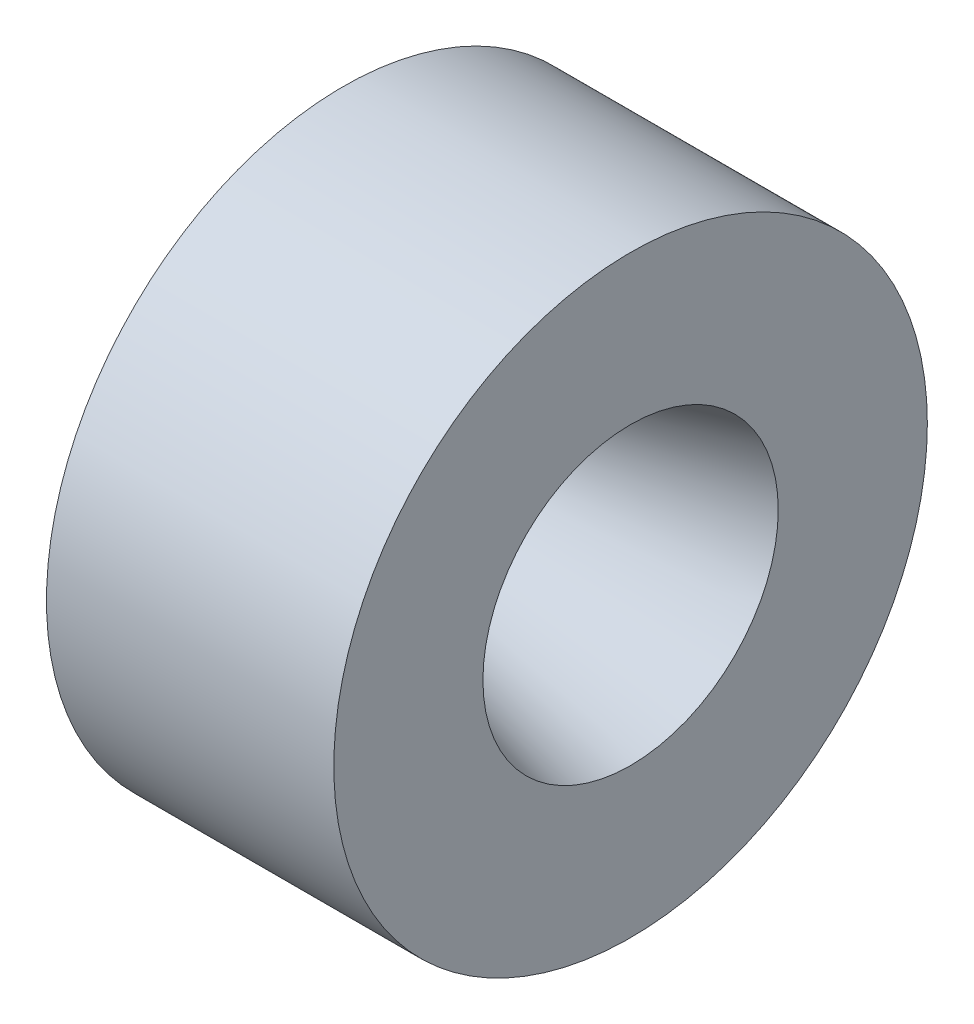
ISO-10303-21;
HEADER;
FILE_DESCRIPTION(('STEP AP214'),'2;1');
FILE_NAME('part.step','',(''),(''),'','','');
FILE_SCHEMA(('AUTOMOTIVE_DESIGN { 1 0 10303 214 1 1 1 1 }'));
ENDSEC;
DATA;
#1=APPLICATION_CONTEXT('core data for automotive mechanical design processes');
#2=APPLICATION_PROTOCOL_DEFINITION('international standard','automotive_design',2000,#1);
#3=PRODUCT_CONTEXT('',#1,'mechanical');
#4=PRODUCT('Part','Part','',(#3));
#5=PRODUCT_RELATED_PRODUCT_CATEGORY('part','',(#4));
#6=PRODUCT_DEFINITION_FORMATION('','',#4);
#7=PRODUCT_DEFINITION_CONTEXT('part definition',#1,'design');
#8=PRODUCT_DEFINITION('design','',#6,#7);
#9=PRODUCT_DEFINITION_SHAPE('','',#8);
#10=(LENGTH_UNIT() NAMED_UNIT(*) SI_UNIT(.MILLI.,.METRE.));
#11=(NAMED_UNIT(*) PLANE_ANGLE_UNIT() SI_UNIT($,.RADIAN.));
#12=(NAMED_UNIT(*) SI_UNIT($,.STERADIAN.) SOLID_ANGLE_UNIT());
#13=UNCERTAINTY_MEASURE_WITH_UNIT(LENGTH_MEASURE(1.E-05),#10,'distance_accuracy_value','');
#14=(GEOMETRIC_REPRESENTATION_CONTEXT(3) GLOBAL_UNCERTAINTY_ASSIGNED_CONTEXT((#13)) GLOBAL_UNIT_ASSIGNED_CONTEXT((#10,
#11,#12)) REPRESENTATION_CONTEXT('',''));
#15=CARTESIAN_POINT('',(0.,0.,0.));
#16=DIRECTION('',(0.,0.,1.));
#17=DIRECTION('',(1.,0.,0.));
#18=AXIS2_PLACEMENT_3D('',#15,#16,#17);
#19=CARTESIAN_POINT('',(152.7302,0.,0.));
#20=DIRECTION('',(1.,0.,0.));
#21=DIRECTION('',(0.,0.,-1.));
#22=AXIS2_PLACEMENT_3D('',#19,#20,#21);
#23=CYLINDRICAL_SURFACE('',#22,52.07);
#24=CARTESIAN_POINT('',(154.3304,0.,0.));
#25=DIRECTION('',(1.,0.,0.));
#26=DIRECTION('',(0.,0.,-1.));
#27=AXIS2_PLACEMENT_3D('',#24,#25,#26);
#28=CIRCLE('',#27,52.07);
#29=CARTESIAN_POINT('',(154.3304,0.,-52.07));
#30=VERTEX_POINT('',#29);
#31=EDGE_CURVE('E64',#30,#30,#28,.T.);
#32=ORIENTED_EDGE('',*,*,#31,.T.);
#33=EDGE_LOOP('',(#32));
#34=FACE_BOUND('',#33,.T.);
#35=CARTESIAN_POINT('',(204.742077662236,0.,0.));
#36=DIRECTION('',(1.,0.,0.));
#37=DIRECTION('',(0.,0.,-1.));
#38=AXIS2_PLACEMENT_3D('',#35,#36,#37);
#39=CIRCLE('',#38,52.07);
#40=CARTESIAN_POINT('',(204.742077662236,0.,-52.07));
#41=VERTEX_POINT('',#40);
#42=EDGE_CURVE('E76',#41,#41,#39,.T.);
#43=ORIENTED_EDGE('',*,*,#42,.F.);
#44=EDGE_LOOP('',(#43));
#45=FACE_BOUND('',#44,.T.);
#46=ADVANCED_FACE('F38',(#34,#45),#23,.T.);
#47=CARTESIAN_POINT('',(154.3304,52.07,0.));
#48=DIRECTION('',(-1.,0.,0.));
#49=DIRECTION('',(0.,0.,1.));
#50=AXIS2_PLACEMENT_3D('',#47,#48,#49);
#51=PLANE('',#50);
#52=CARTESIAN_POINT('',(154.3304,0.,0.));
#53=DIRECTION('',(-1.,0.,0.));
#54=DIRECTION('',(0.,0.,1.));
#55=AXIS2_PLACEMENT_3D('',#52,#53,#54);
#56=CIRCLE('',#55,43.942);
#57=CARTESIAN_POINT('',(154.3304,0.,43.942));
#58=VERTEX_POINT('',#57);
#59=EDGE_CURVE('E61',#58,#58,#56,.F.);
#60=ORIENTED_EDGE('',*,*,#59,.T.);
#61=EDGE_LOOP('',(#60));
#62=FACE_BOUND('',#61,.T.);
#63=ORIENTED_EDGE('',*,*,#31,.F.);
#64=EDGE_LOOP('',(#63));
#65=FACE_BOUND('',#64,.T.);
#66=ADVANCED_FACE('F84',(#62,#65),#51,.T.);
#67=CARTESIAN_POINT('',(152.7302,0.,0.));
#68=DIRECTION('',(1.,0.,0.));
#69=DIRECTION('',(0.,0.,-1.));
#70=AXIS2_PLACEMENT_3D('',#67,#68,#69);
#71=CYLINDRICAL_SURFACE('',#70,43.688);
#72=CARTESIAN_POINT('',(154.0764,0.,0.));
#73=DIRECTION('',(-1.,0.,0.));
#74=DIRECTION('',(0.,0.,1.));
#75=AXIS2_PLACEMENT_3D('',#72,#73,#74);
#76=CIRCLE('',#75,43.688);
#77=CARTESIAN_POINT('',(154.0764,0.,43.688));
#78=VERTEX_POINT('',#77);
#79=EDGE_CURVE('E58',#78,#78,#76,.T.);
#80=ORIENTED_EDGE('',*,*,#79,.T.);
#81=EDGE_LOOP('',(#80));
#82=FACE_BOUND('',#81,.T.);
#83=CARTESIAN_POINT('',(151.7904,0.,0.));
#84=DIRECTION('',(1.,0.,0.));
#85=DIRECTION('',(0.,0.,-1.));
#86=AXIS2_PLACEMENT_3D('',#83,#84,#85);
#87=CIRCLE('',#86,43.688);
#88=CARTESIAN_POINT('',(151.7904,0.,-43.688));
#89=VERTEX_POINT('',#88);
#90=EDGE_CURVE('E67',#89,#89,#87,.T.);
#91=ORIENTED_EDGE('',*,*,#90,.T.);
#92=EDGE_LOOP('',(#91));
#93=FACE_BOUND('',#92,.T.);
#94=ADVANCED_FACE('F91',(#82,#93),#71,.T.);
#95=CARTESIAN_POINT('',(151.7904,43.688,0.));
#96=DIRECTION('',(-1.,0.,0.));
#97=DIRECTION('',(0.,0.,1.));
#98=AXIS2_PLACEMENT_3D('',#95,#96,#97);
#99=PLANE('',#98);
#100=CARTESIAN_POINT('',(151.7904,0.,0.));
#101=DIRECTION('',(1.,0.,0.));
#102=DIRECTION('',(0.,0.,-1.));
#103=AXIS2_PLACEMENT_3D('',#100,#101,#102);
#104=CIRCLE('',#103,41.148);
#105=CARTESIAN_POINT('',(151.7904,0.,-41.148));
#106=VERTEX_POINT('',#105);
#107=EDGE_CURVE('E70',#106,#106,#104,.T.);
#108=ORIENTED_EDGE('',*,*,#107,.T.);
#109=EDGE_LOOP('',(#108));
#110=FACE_BOUND('',#109,.T.);
#111=ORIENTED_EDGE('',*,*,#90,.F.);
#112=EDGE_LOOP('',(#111));
#113=FACE_BOUND('',#112,.T.);
#114=ADVANCED_FACE('F123',(#110,#113),#99,.T.);
#115=CARTESIAN_POINT('',(152.7302,0.,0.));
#116=DIRECTION('',(1.,0.,0.));
#117=DIRECTION('',(0.,0.,-1.));
#118=AXIS2_PLACEMENT_3D('',#115,#116,#117);
#119=CYLINDRICAL_SURFACE('',#118,41.148);
#120=CARTESIAN_POINT('',(152.347039537398,0.,0.));
#121=DIRECTION('',(1.,0.,0.));
#122=DIRECTION('',(0.,0.,-1.));
#123=AXIS2_PLACEMENT_3D('',#120,#121,#122);
#124=CIRCLE('',#123,41.148);
#125=CARTESIAN_POINT('',(152.347039537398,0.,-41.148));
#126=VERTEX_POINT('',#125);
#127=EDGE_CURVE('E45',#126,#126,#124,.T.);
#128=ORIENTED_EDGE('',*,*,#127,.T.);
#129=EDGE_LOOP('',(#128));
#130=FACE_BOUND('',#129,.T.);
#131=ORIENTED_EDGE('',*,*,#107,.F.);
#132=EDGE_LOOP('',(#131));
#133=FACE_BOUND('',#132,.T.);
#134=ADVANCED_FACE('F114',(#130,#133),#119,.F.);
#135=CARTESIAN_POINT('',(154.3304,0.,0.));
#136=DIRECTION('',(-1.,0.,0.));
#137=DIRECTION('',(0.,0.,1.));
#138=AXIS2_PLACEMENT_3D('',#135,#136,#137);
#139=CONICAL_SURFACE('',#138,41.148,0.959931088596884);
#140=CARTESIAN_POINT('',(155.468008826139,0.,0.));
#141=DIRECTION('',(-1.,0.,0.));
#142=DIRECTION('',(0.,0.,1.));
#143=AXIS2_PLACEMENT_3D('',#140,#141,#142);
#144=CIRCLE('',#143,39.5233262224975);
#145=CARTESIAN_POINT('',(155.468008826139,0.,39.5233262224975));
#146=VERTEX_POINT('',#145);
#147=EDGE_CURVE('E10',#146,#146,#144,.T.);
#148=ORIENTED_EDGE('',*,*,#147,.T.);
#149=EDGE_LOOP('',(#148));
#150=FACE_BOUND('',#149,.T.);
#151=CARTESIAN_POINT('',(170.769703079932,0.,0.));
#152=DIRECTION('',(1.,0.,0.));
#153=DIRECTION('',(0.,0.,-1.));
#154=AXIS2_PLACEMENT_3D('',#151,#152,#153);
#155=CIRCLE('',#154,17.6702420741658);
#156=CARTESIAN_POINT('',(170.769703079932,0.,-17.6702420741658));
#157=VERTEX_POINT('',#156);
#158=EDGE_CURVE('E53',#157,#157,#155,.T.);
#159=ORIENTED_EDGE('',*,*,#158,.T.);
#160=EDGE_LOOP('',(#159));
#161=FACE_BOUND('',#160,.T.);
#162=ADVANCED_FACE('F111',(#150,#161),#139,.F.);
#163=CARTESIAN_POINT('',(171.279763711412,0.,0.));
#164=DIRECTION('',(1.,0.,0.));
#165=DIRECTION('',(0.,0.,-1.));
#166=AXIS2_PLACEMENT_3D('',#163,#164,#165);
#167=CONICAL_SURFACE('',#166,16.9418,0.26179938779915);
#168=CARTESIAN_POINT('',(172.138726363459,0.,0.));
#169=DIRECTION('',(-1.,0.,0.));
#170=DIRECTION('',(0.,0.,1.));
#171=AXIS2_PLACEMENT_3D('',#168,#169,#170);
#172=CIRCLE('',#171,17.1719583489445);
#173=CARTESIAN_POINT('',(172.138726363459,0.,17.1719583489445));
#174=VERTEX_POINT('',#173);
#175=EDGE_CURVE('E49',#174,#174,#172,.T.);
#176=ORIENTED_EDGE('',*,*,#175,.T.);
#177=EDGE_LOOP('',(#176));
#178=FACE_BOUND('',#177,.T.);
#179=CARTESIAN_POINT('',(204.742077662236,0.,0.));
#180=DIRECTION('',(1.,0.,0.));
#181=DIRECTION('',(0.,0.,-1.));
#182=AXIS2_PLACEMENT_3D('',#179,#180,#181);
#183=CIRCLE('',#182,25.908);
#184=CARTESIAN_POINT('',(204.742077662236,0.,-25.908));
#185=VERTEX_POINT('',#184);
#186=EDGE_CURVE('E73',#185,#185,#183,.T.);
#187=ORIENTED_EDGE('',*,*,#186,.T.);
#188=EDGE_LOOP('',(#187));
#189=FACE_BOUND('',#188,.T.);
#190=ADVANCED_FACE('F113',(#178,#189),#167,.F.);
#191=CARTESIAN_POINT('',(204.742077662236,25.908,0.));
#192=DIRECTION('',(1.,0.,0.));
#193=DIRECTION('',(0.,0.,-1.));
#194=AXIS2_PLACEMENT_3D('',#191,#192,#193);
#195=PLANE('',#194);
#196=ORIENTED_EDGE('',*,*,#42,.T.);
#197=EDGE_LOOP('',(#196));
#198=FACE_BOUND('',#197,.T.);
#199=ORIENTED_EDGE('',*,*,#186,.F.);
#200=EDGE_LOOP('',(#199));
#201=FACE_BOUND('',#200,.T.);
#202=ADVANCED_FACE('F80',(#198,#201),#195,.T.);
#203=CARTESIAN_POINT('',(154.0764,0.,0.));
#204=DIRECTION('',(-1.,0.,0.));
#205=DIRECTION('',(0.,0.,1.));
#206=AXIS2_PLACEMENT_3D('',#203,#204,#205);
#207=TOROIDAL_SURFACE('',#206,43.942,0.254);
#208=ORIENTED_EDGE('',*,*,#79,.F.);
#209=EDGE_LOOP('',(#208));
#210=FACE_BOUND('',#209,.T.);
#211=ORIENTED_EDGE('',*,*,#59,.F.);
#212=EDGE_LOOP('',(#211));
#213=FACE_BOUND('',#212,.T.);
#214=ADVANCED_FACE('F96',(#210,#213),#207,.F.);
#215=CARTESIAN_POINT('',(171.810026176179,0.,0.));
#216=DIRECTION('',(-1.,0.,0.));
#217=DIRECTION('',(0.,0.,1.));
#218=AXIS2_PLACEMENT_3D('',#215,#216,#217);
#219=TOROIDAL_SURFACE('',#218,18.3986841483317,1.27);
#220=ORIENTED_EDGE('',*,*,#175,.F.);
#221=EDGE_LOOP('',(#220));
#222=FACE_BOUND('',#221,.T.);
#223=ORIENTED_EDGE('',*,*,#158,.F.);
#224=EDGE_LOOP('',(#223));
#225=FACE_BOUND('',#224,.T.);
#226=ADVANCED_FACE('F98',(#222,#225),#219,.T.);
#227=CARTESIAN_POINT('',(152.347039537398,0.,0.));
#228=DIRECTION('',(1.,0.,0.));
#229=DIRECTION('',(0.,0.,-1.));
#230=AXIS2_PLACEMENT_3D('',#227,#228,#229);
#231=TOROIDAL_SURFACE('',#230,37.338,3.81);
#232=ORIENTED_EDGE('',*,*,#147,.F.);
#233=EDGE_LOOP('',(#232));
#234=FACE_BOUND('',#233,.T.);
#235=ORIENTED_EDGE('',*,*,#127,.F.);
#236=EDGE_LOOP('',(#235));
#237=FACE_BOUND('',#236,.T.);
#238=ADVANCED_FACE('F40',(#234,#237),#231,.F.);
#239=CLOSED_SHELL('',(#46,#66,#94,#114,#134,#162,#190,#202,#214,#226,#238));
#240=MANIFOLD_SOLID_BREP('B2',#239);
#241=ADVANCED_BREP_SHAPE_REPRESENTATION('',(#18,#240),#14);
#242=SHAPE_DEFINITION_REPRESENTATION(#9,#241);
ENDSEC;
END-ISO-10303-21;
